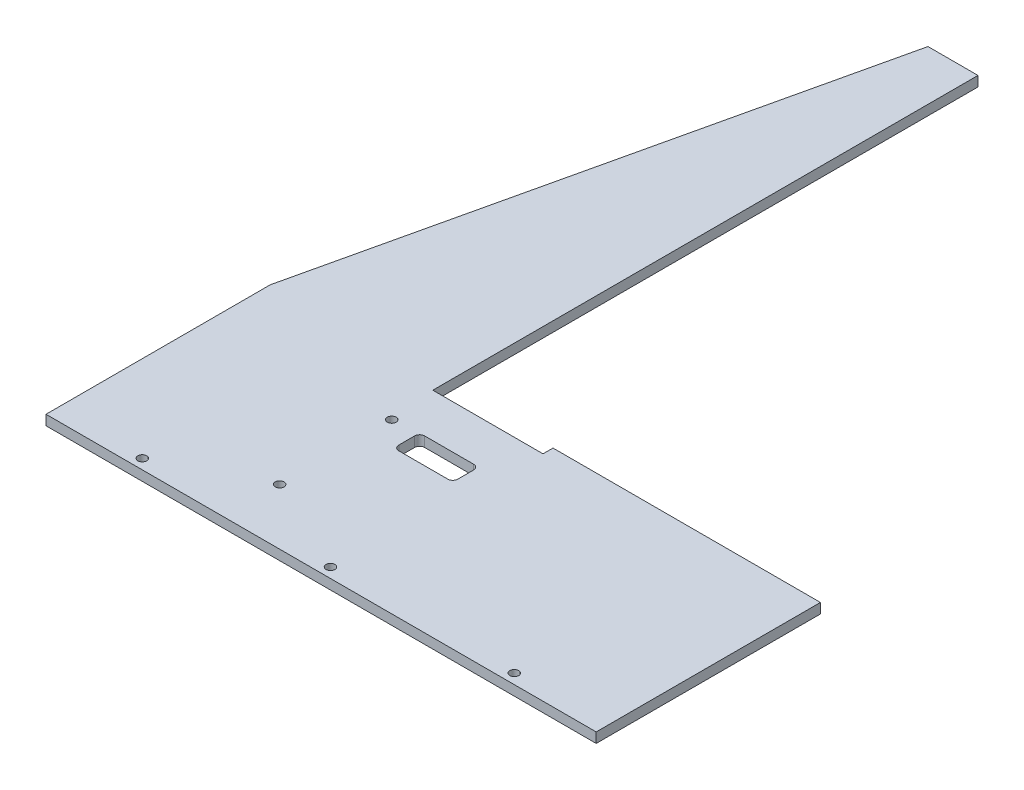
ISO-10303-21;
HEADER;
FILE_DESCRIPTION(('STEP AP214'),'2;1');
FILE_NAME('part.step','',(''),(''),'','','');
FILE_SCHEMA(('AUTOMOTIVE_DESIGN { 1 0 10303 214 1 1 1 1 }'));
ENDSEC;
DATA;
#1=APPLICATION_CONTEXT('core data for automotive mechanical design processes');
#2=APPLICATION_PROTOCOL_DEFINITION('international standard','automotive_design',2000,#1);
#3=PRODUCT_CONTEXT('',#1,'mechanical');
#4=PRODUCT('Part','Part','',(#3));
#5=PRODUCT_RELATED_PRODUCT_CATEGORY('part','',(#4));
#6=PRODUCT_DEFINITION_FORMATION('','',#4);
#7=PRODUCT_DEFINITION_CONTEXT('part definition',#1,'design');
#8=PRODUCT_DEFINITION('design','',#6,#7);
#9=PRODUCT_DEFINITION_SHAPE('','',#8);
#10=(LENGTH_UNIT() NAMED_UNIT(*) SI_UNIT(.MILLI.,.METRE.));
#11=(NAMED_UNIT(*) PLANE_ANGLE_UNIT() SI_UNIT($,.RADIAN.));
#12=(NAMED_UNIT(*) SI_UNIT($,.STERADIAN.) SOLID_ANGLE_UNIT());
#13=UNCERTAINTY_MEASURE_WITH_UNIT(LENGTH_MEASURE(1.E-05),#10,'distance_accuracy_value','');
#14=(GEOMETRIC_REPRESENTATION_CONTEXT(3) GLOBAL_UNCERTAINTY_ASSIGNED_CONTEXT((#13)) GLOBAL_UNIT_ASSIGNED_CONTEXT((#10,
#11,#12)) REPRESENTATION_CONTEXT('',''));
#15=CARTESIAN_POINT('',(0.,0.,0.));
#16=DIRECTION('',(0.,0.,1.));
#17=DIRECTION('',(1.,0.,0.));
#18=AXIS2_PLACEMENT_3D('',#15,#16,#17);
#19=CARTESIAN_POINT('',(224.613859637391,-4.83904434096861,62.9747166997346));
#20=DIRECTION('',(0.,0.,-1.));
#21=DIRECTION('',(-1.,0.,0.));
#22=AXIS2_PLACEMENT_3D('',#19,#20,#21);
#23=PLANE('',#22);
#24=DIRECTION('',(1.,0.,0.));
#25=VECTOR('',#24,1.);
#26=CARTESIAN_POINT('',(224.613859637391,-10.8390443409686,62.9747166997346));
#27=LINE('',#26,#25);
#28=CARTESIAN_POINT('',(-105.386140362609,-10.8390443409686,62.9747166997346));
#29=VERTEX_POINT('',#28);
#30=CARTESIAN_POINT('',(224.613859637391,-10.8390443409686,62.9747166997346));
#31=VERTEX_POINT('',#30);
#32=EDGE_CURVE('E225',#29,#31,#27,.T.);
#33=ORIENTED_EDGE('',*,*,#32,.T.);
#34=DIRECTION('',(0.,-1.,0.));
#35=VECTOR('',#34,1.);
#36=CARTESIAN_POINT('',(224.613859637391,-4.83904434096861,62.9747166997346));
#37=LINE('',#36,#35);
#38=CARTESIAN_POINT('',(224.613859637391,-4.83904434096861,62.9747166997346));
#39=VERTEX_POINT('',#38);
#40=EDGE_CURVE('E266',#39,#31,#37,.T.);
#41=ORIENTED_EDGE('',*,*,#40,.F.);
#42=DIRECTION('',(1.,0.,0.));
#43=VECTOR('',#42,1.);
#44=CARTESIAN_POINT('',(224.613859637391,-4.83904434096861,62.9747166997346));
#45=LINE('',#44,#43);
#46=CARTESIAN_POINT('',(-105.386140362609,-4.83904434096861,62.9747166997346));
#47=VERTEX_POINT('',#46);
#48=EDGE_CURVE('E226',#47,#39,#45,.T.);
#49=ORIENTED_EDGE('',*,*,#48,.F.);
#50=DIRECTION('',(0.,-1.,0.));
#51=VECTOR('',#50,1.);
#52=CARTESIAN_POINT('',(-105.386140362609,-4.83904434096861,62.9747166997346));
#53=LINE('',#52,#51);
#54=EDGE_CURVE('E242',#47,#29,#53,.T.);
#55=ORIENTED_EDGE('',*,*,#54,.T.);
#56=EDGE_LOOP('',(#33,#41,#49,#55));
#57=FACE_BOUND('',#56,.T.);
#58=ADVANCED_FACE('F35',(#57),#23,.F.);
#59=CARTESIAN_POINT('',(224.613859637391,-4.83904434096861,-71.5252833002654));
#60=DIRECTION('',(-1.,0.,0.));
#61=DIRECTION('',(0.,0.,1.));
#62=AXIS2_PLACEMENT_3D('',#59,#60,#61);
#63=PLANE('',#62);
#64=DIRECTION('',(0.,0.,-1.));
#65=VECTOR('',#64,1.);
#66=CARTESIAN_POINT('',(224.613859637391,-10.8390443409686,-71.5252833002654));
#67=LINE('',#66,#65);
#68=CARTESIAN_POINT('',(224.613859637391,-10.8390443409686,-71.5252833002654));
#69=VERTEX_POINT('',#68);
#70=EDGE_CURVE('E245',#31,#69,#67,.T.);
#71=ORIENTED_EDGE('',*,*,#70,.T.);
#72=DIRECTION('',(0.,-1.,0.));
#73=VECTOR('',#72,1.);
#74=CARTESIAN_POINT('',(224.613859637391,-4.83904434096861,-71.5252833002654));
#75=LINE('',#74,#73);
#76=CARTESIAN_POINT('',(224.613859637391,-4.83904434096861,-71.5252833002654));
#77=VERTEX_POINT('',#76);
#78=EDGE_CURVE('E263',#77,#69,#75,.T.);
#79=ORIENTED_EDGE('',*,*,#78,.F.);
#80=DIRECTION('',(0.,0.,-1.));
#81=VECTOR('',#80,1.);
#82=CARTESIAN_POINT('',(224.613859637391,-4.83904434096861,-71.5252833002654));
#83=LINE('',#82,#81);
#84=EDGE_CURVE('E229',#39,#77,#83,.T.);
#85=ORIENTED_EDGE('',*,*,#84,.F.);
#86=ORIENTED_EDGE('',*,*,#40,.T.);
#87=EDGE_LOOP('',(#71,#79,#85,#86));
#88=FACE_BOUND('',#87,.T.);
#89=ADVANCED_FACE('F357',(#88),#63,.F.);
#90=CARTESIAN_POINT('',(-1.88614036260915,-4.83904434096861,-71.5252833002654));
#91=DIRECTION('',(0.,0.,1.));
#92=DIRECTION('',(1.,0.,0.));
#93=AXIS2_PLACEMENT_3D('',#90,#91,#92);
#94=PLANE('',#93);
#95=DIRECTION('',(-1.,0.,0.));
#96=VECTOR('',#95,1.);
#97=CARTESIAN_POINT('',(-1.88614036260915,-10.8390443409686,-71.5252833002654));
#98=LINE('',#97,#96);
#99=CARTESIAN_POINT('',(64.2138596373908,-10.8390443409686,-71.5252833002654));
#100=VERTEX_POINT('',#99);
#101=EDGE_CURVE('E166',#69,#100,#98,.T.);
#102=ORIENTED_EDGE('',*,*,#101,.T.);
#103=DIRECTION('',(0.,1.,0.));
#104=VECTOR('',#103,1.);
#105=CARTESIAN_POINT('',(64.2138596373908,-10.8390443409686,-71.5252833002654));
#106=LINE('',#105,#104);
#107=CARTESIAN_POINT('',(64.2138596373908,-4.83904434096861,-71.5252833002654));
#108=VERTEX_POINT('',#107);
#109=EDGE_CURVE('E191',#100,#108,#106,.T.);
#110=ORIENTED_EDGE('',*,*,#109,.T.);
#111=DIRECTION('',(-1.,0.,0.));
#112=VECTOR('',#111,1.);
#113=CARTESIAN_POINT('',(-1.88614036260915,-4.83904434096861,-71.5252833002654));
#114=LINE('',#113,#112);
#115=EDGE_CURVE('E232',#77,#108,#114,.T.);
#116=ORIENTED_EDGE('',*,*,#115,.F.);
#117=ORIENTED_EDGE('',*,*,#78,.T.);
#118=EDGE_LOOP('',(#102,#110,#116,#117));
#119=FACE_BOUND('',#118,.T.);
#120=ADVANCED_FACE('F363',(#119),#94,.F.);
#121=CARTESIAN_POINT('',(-1.88614036260919,-4.83904434096861,-392.525283300265));
#122=DIRECTION('',(-1.,0.,0.));
#123=DIRECTION('',(0.,0.,1.));
#124=AXIS2_PLACEMENT_3D('',#121,#122,#123);
#125=PLANE('',#124);
#126=DIRECTION('',(0.,0.,-1.));
#127=VECTOR('',#126,1.);
#128=CARTESIAN_POINT('',(-1.88614036260919,-10.8390443409686,-392.525283300265));
#129=LINE('',#128,#127);
#130=CARTESIAN_POINT('',(-1.88614036260915,-10.8390443409686,-65.5252833002654));
#131=VERTEX_POINT('',#130);
#132=CARTESIAN_POINT('',(-1.88614036260919,-10.8390443409686,-392.525283300265));
#133=VERTEX_POINT('',#132);
#134=EDGE_CURVE('E154',#131,#133,#129,.T.);
#135=ORIENTED_EDGE('',*,*,#134,.T.);
#136=DIRECTION('',(0.,-1.,0.));
#137=VECTOR('',#136,1.);
#138=CARTESIAN_POINT('',(-1.88614036260919,-4.83904434096861,-392.525283300265));
#139=LINE('',#138,#137);
#140=CARTESIAN_POINT('',(-1.88614036260919,-4.83904434096861,-392.525283300265));
#141=VERTEX_POINT('',#140);
#142=EDGE_CURVE('E261',#141,#133,#139,.T.);
#143=ORIENTED_EDGE('',*,*,#142,.F.);
#144=DIRECTION('',(0.,0.,-1.));
#145=VECTOR('',#144,1.);
#146=CARTESIAN_POINT('',(-1.88614036260919,-4.83904434096861,-392.525283300265));
#147=LINE('',#146,#145);
#148=CARTESIAN_POINT('',(-1.88614036260915,-4.83904434096861,-65.5252833002654));
#149=VERTEX_POINT('',#148);
#150=EDGE_CURVE('E171',#149,#141,#147,.T.);
#151=ORIENTED_EDGE('',*,*,#150,.F.);
#152=DIRECTION('',(0.,1.,0.));
#153=VECTOR('',#152,1.);
#154=CARTESIAN_POINT('',(-1.88614036260915,-10.8390443409686,-65.5252833002654));
#155=LINE('',#154,#153);
#156=EDGE_CURVE('E169',#131,#149,#155,.T.);
#157=ORIENTED_EDGE('',*,*,#156,.F.);
#158=EDGE_LOOP('',(#135,#143,#151,#157));
#159=FACE_BOUND('',#158,.T.);
#160=ADVANCED_FACE('F170',(#159),#125,.F.);
#161=CARTESIAN_POINT('',(-31.8861403626092,-4.83904434096861,-392.525283300265));
#162=DIRECTION('',(0.,0.,1.));
#163=DIRECTION('',(1.,0.,0.));
#164=AXIS2_PLACEMENT_3D('',#161,#162,#163);
#165=PLANE('',#164);
#166=DIRECTION('',(-1.,0.,0.));
#167=VECTOR('',#166,1.);
#168=CARTESIAN_POINT('',(-31.8861403626092,-10.8390443409686,-392.525283300265));
#169=LINE('',#168,#167);
#170=CARTESIAN_POINT('',(-31.8861403626092,-10.8390443409686,-392.525283300265));
#171=VERTEX_POINT('',#170);
#172=EDGE_CURVE('E162',#133,#171,#169,.T.);
#173=ORIENTED_EDGE('',*,*,#172,.T.);
#174=DIRECTION('',(0.,-1.,0.));
#175=VECTOR('',#174,1.);
#176=CARTESIAN_POINT('',(-31.8861403626092,-4.83904434096861,-392.525283300265));
#177=LINE('',#176,#175);
#178=CARTESIAN_POINT('',(-31.8861403626092,-4.83904434096861,-392.525283300265));
#179=VERTEX_POINT('',#178);
#180=EDGE_CURVE('E258',#179,#171,#177,.T.);
#181=ORIENTED_EDGE('',*,*,#180,.F.);
#182=DIRECTION('',(-1.,0.,0.));
#183=VECTOR('',#182,1.);
#184=CARTESIAN_POINT('',(-31.8861403626092,-4.83904434096861,-392.525283300265));
#185=LINE('',#184,#183);
#186=EDGE_CURVE('E236',#141,#179,#185,.T.);
#187=ORIENTED_EDGE('',*,*,#186,.F.);
#188=ORIENTED_EDGE('',*,*,#142,.T.);
#189=EDGE_LOOP('',(#173,#181,#187,#188));
#190=FACE_BOUND('',#189,.T.);
#191=ADVANCED_FACE('F418',(#190),#165,.F.);
#192=CARTESIAN_POINT('',(-105.386140362609,-4.83904434096861,-71.5252833002654));
#193=DIRECTION('',(0.974773625713798,0.,0.223195830186804));
#194=DIRECTION('',(0.223195830186804,0.,-0.974773625713798));
#195=AXIS2_PLACEMENT_3D('',#192,#193,#194);
#196=PLANE('',#195);
#197=DIRECTION('',(-0.223195830186804,0.,0.974773625713798));
#198=VECTOR('',#197,1.);
#199=CARTESIAN_POINT('',(-105.386140362609,-10.8390443409686,-71.5252833002654));
#200=LINE('',#199,#198);
#201=CARTESIAN_POINT('',(-105.386140362609,-10.8390443409686,-71.5252833002654));
#202=VERTEX_POINT('',#201);
#203=EDGE_CURVE('E250',#171,#202,#200,.T.);
#204=ORIENTED_EDGE('',*,*,#203,.T.);
#205=DIRECTION('',(0.,-1.,0.));
#206=VECTOR('',#205,1.);
#207=CARTESIAN_POINT('',(-105.386140362609,-4.83904434096861,-71.5252833002654));
#208=LINE('',#207,#206);
#209=CARTESIAN_POINT('',(-105.386140362609,-4.83904434096861,-71.5252833002654));
#210=VERTEX_POINT('',#209);
#211=EDGE_CURVE('E255',#210,#202,#208,.T.);
#212=ORIENTED_EDGE('',*,*,#211,.F.);
#213=DIRECTION('',(-0.223195830186804,0.,0.974773625713798));
#214=VECTOR('',#213,1.);
#215=CARTESIAN_POINT('',(-105.386140362609,-4.83904434096861,-71.5252833002654));
#216=LINE('',#215,#214);
#217=EDGE_CURVE('E238',#179,#210,#216,.T.);
#218=ORIENTED_EDGE('',*,*,#217,.F.);
#219=ORIENTED_EDGE('',*,*,#180,.T.);
#220=EDGE_LOOP('',(#204,#212,#218,#219));
#221=FACE_BOUND('',#220,.T.);
#222=ADVANCED_FACE('F414',(#221),#196,.F.);
#223=CARTESIAN_POINT('',(-105.386140362609,-4.83904434096861,62.9747166997346));
#224=DIRECTION('',(1.,0.,0.));
#225=DIRECTION('',(0.,0.,-1.));
#226=AXIS2_PLACEMENT_3D('',#223,#224,#225);
#227=PLANE('',#226);
#228=DIRECTION('',(0.,0.,1.));
#229=VECTOR('',#228,1.);
#230=CARTESIAN_POINT('',(-105.386140362609,-10.8390443409686,62.9747166997346));
#231=LINE('',#230,#229);
#232=EDGE_CURVE('E230',#202,#29,#231,.T.);
#233=ORIENTED_EDGE('',*,*,#232,.T.);
#234=ORIENTED_EDGE('',*,*,#54,.F.);
#235=DIRECTION('',(0.,0.,1.));
#236=VECTOR('',#235,1.);
#237=CARTESIAN_POINT('',(-105.386140362609,-4.83904434096861,62.9747166997346));
#238=LINE('',#237,#236);
#239=EDGE_CURVE('E240',#210,#47,#238,.T.);
#240=ORIENTED_EDGE('',*,*,#239,.F.);
#241=ORIENTED_EDGE('',*,*,#211,.T.);
#242=EDGE_LOOP('',(#233,#234,#240,#241));
#243=FACE_BOUND('',#242,.T.);
#244=ADVANCED_FACE('F409',(#243),#227,.F.);
#245=CARTESIAN_POINT('',(-105.386140362609,-4.83904434096861,62.9747166997346));
#246=DIRECTION('',(0.,-1.,0.));
#247=DIRECTION('',(0.,0.,-1.));
#248=AXIS2_PLACEMENT_3D('',#245,#246,#247);
#249=PLANE('',#248);
#250=DIRECTION('',(1.,0.,0.));
#251=VECTOR('',#250,1.);
#252=CARTESIAN_POINT('',(16.4138596373909,-4.83904434096861,-23.8252833002657));
#253=LINE('',#252,#251);
#254=CARTESIAN_POINT('',(19.4138596373909,-4.83904434096861,-23.8252833002657));
#255=VERTEX_POINT('',#254);
#256=CARTESIAN_POINT('',(48.8138596373909,-4.83904434096861,-23.8252833002657));
#257=VERTEX_POINT('',#256);
#258=EDGE_CURVE('E328',#255,#257,#253,.T.);
#259=ORIENTED_EDGE('',*,*,#258,.F.);
#260=CARTESIAN_POINT('',(19.4138596373909,-4.83904434096861,-26.8252833002657));
#261=DIRECTION('',(0.,-1.,0.));
#262=DIRECTION('',(0.,0.,-1.));
#263=AXIS2_PLACEMENT_3D('',#260,#261,#262);
#264=CIRCLE('',#263,3.);
#265=CARTESIAN_POINT('',(16.4138596373909,-4.83904434096861,-26.8252833002657));
#266=VERTEX_POINT('',#265);
#267=EDGE_CURVE('E296',#255,#266,#264,.T.);
#268=ORIENTED_EDGE('',*,*,#267,.T.);
#269=DIRECTION('',(0.,0.,1.));
#270=VECTOR('',#269,1.);
#271=CARTESIAN_POINT('',(16.4138596373909,-4.83904434096861,-39.3252833002654));
#272=LINE('',#271,#270);
#273=CARTESIAN_POINT('',(16.4138596373909,-4.83904434096861,-36.3252833002654));
#274=VERTEX_POINT('',#273);
#275=EDGE_CURVE('E306',#274,#266,#272,.T.);
#276=ORIENTED_EDGE('',*,*,#275,.F.);
#277=CARTESIAN_POINT('',(19.4138596373909,-4.83904434096861,-36.3252833002654));
#278=DIRECTION('',(0.,-1.,0.));
#279=DIRECTION('',(0.,0.,-1.));
#280=AXIS2_PLACEMENT_3D('',#277,#278,#279);
#281=CIRCLE('',#280,3.);
#282=CARTESIAN_POINT('',(19.4138596373909,-4.83904434096861,-39.3252833002654));
#283=VERTEX_POINT('',#282);
#284=EDGE_CURVE('E43',#274,#283,#281,.T.);
#285=ORIENTED_EDGE('',*,*,#284,.T.);
#286=DIRECTION('',(-1.,0.,0.));
#287=VECTOR('',#286,1.);
#288=CARTESIAN_POINT('',(16.4138596373909,-4.83904434096861,-39.3252833002654));
#289=LINE('',#288,#287);
#290=CARTESIAN_POINT('',(48.8138596373909,-4.83904434096861,-39.3252833002654));
#291=VERTEX_POINT('',#290);
#292=EDGE_CURVE('E186',#291,#283,#289,.T.);
#293=ORIENTED_EDGE('',*,*,#292,.F.);
#294=CARTESIAN_POINT('',(48.8138596373909,-4.83904434096861,-36.3252833002654));
#295=DIRECTION('',(0.,-1.,0.));
#296=DIRECTION('',(0.,0.,-1.));
#297=AXIS2_PLACEMENT_3D('',#294,#295,#296);
#298=CIRCLE('',#297,3.);
#299=CARTESIAN_POINT('',(51.8138596373909,-4.83904434096861,-36.3252833002654));
#300=VERTEX_POINT('',#299);
#301=EDGE_CURVE('E288',#291,#300,#298,.T.);
#302=ORIENTED_EDGE('',*,*,#301,.T.);
#303=DIRECTION('',(0.,0.,-1.));
#304=VECTOR('',#303,1.);
#305=CARTESIAN_POINT('',(51.8138596373909,-4.83904434096861,-39.3252833002654));
#306=LINE('',#305,#304);
#307=CARTESIAN_POINT('',(51.8138596373909,-4.83904434096861,-26.8252833002657));
#308=VERTEX_POINT('',#307);
#309=EDGE_CURVE('E315',#308,#300,#306,.T.);
#310=ORIENTED_EDGE('',*,*,#309,.F.);
#311=CARTESIAN_POINT('',(48.8138596373909,-4.83904434096861,-26.8252833002657));
#312=DIRECTION('',(0.,-1.,0.));
#313=DIRECTION('',(0.,0.,-1.));
#314=AXIS2_PLACEMENT_3D('',#311,#312,#313);
#315=CIRCLE('',#314,3.);
#316=EDGE_CURVE('E292',#308,#257,#315,.T.);
#317=ORIENTED_EDGE('',*,*,#316,.T.);
#318=EDGE_LOOP('',(#259,#268,#276,#285,#293,#302,#310,#317));
#319=FACE_BOUND('',#318,.T.);
#320=CARTESIAN_POINT('',(-53.6361403626092,-4.83904434096861,56.9747166997346));
#321=DIRECTION('',(0.,1.,0.));
#322=DIRECTION('',(0.,0.,1.));
#323=AXIS2_PLACEMENT_3D('',#320,#321,#322);
#324=CIRCLE('',#323,2.64999999999999);
#325=CARTESIAN_POINT('',(-53.6361403626092,-4.83904434096861,59.6247166997346));
#326=VERTEX_POINT('',#325);
#327=EDGE_CURVE('E194',#326,#326,#324,.T.);
#328=ORIENTED_EDGE('',*,*,#327,.F.);
#329=EDGE_LOOP('',(#328));
#330=FACE_BOUND('',#329,.T.);
#331=CARTESIAN_POINT('',(59.2388596373907,-4.83904434096861,56.9747166997346));
#332=DIRECTION('',(0.,1.,0.));
#333=DIRECTION('',(0.,0.,1.));
#334=AXIS2_PLACEMENT_3D('',#331,#332,#333);
#335=CIRCLE('',#334,2.64999999999999);
#336=CARTESIAN_POINT('',(59.2388596373907,-4.83904434096861,59.6247166997346));
#337=VERTEX_POINT('',#336);
#338=EDGE_CURVE('E201',#337,#337,#335,.T.);
#339=ORIENTED_EDGE('',*,*,#338,.F.);
#340=EDGE_LOOP('',(#339));
#341=FACE_BOUND('',#340,.T.);
#342=CARTESIAN_POINT('',(169.488859637391,-4.83904434096861,56.9747166997346));
#343=DIRECTION('',(0.,1.,0.));
#344=DIRECTION('',(0.,0.,1.));
#345=AXIS2_PLACEMENT_3D('',#342,#343,#344);
#346=CIRCLE('',#345,2.64999999999999);
#347=CARTESIAN_POINT('',(169.488859637391,-4.83904434096861,59.6247166997346));
#348=VERTEX_POINT('',#347);
#349=EDGE_CURVE('E207',#348,#348,#346,.T.);
#350=ORIENTED_EDGE('',*,*,#349,.F.);
#351=EDGE_LOOP('',(#350));
#352=FACE_BOUND('',#351,.T.);
#353=CARTESIAN_POINT('',(1.11385963739087,-4.83904434096861,29.3497166997346));
#354=DIRECTION('',(0.,1.,0.));
#355=DIRECTION('',(0.,0.,1.));
#356=AXIS2_PLACEMENT_3D('',#353,#354,#355);
#357=CIRCLE('',#356,2.64999999999999);
#358=CARTESIAN_POINT('',(1.11385963739087,-4.83904434096861,31.9997166997346));
#359=VERTEX_POINT('',#358);
#360=EDGE_CURVE('E213',#359,#359,#357,.T.);
#361=ORIENTED_EDGE('',*,*,#360,.F.);
#362=EDGE_LOOP('',(#361));
#363=FACE_BOUND('',#362,.T.);
#364=CARTESIAN_POINT('',(1.11385963739086,-4.83904434096861,-37.9002833002654));
#365=DIRECTION('',(0.,1.,0.));
#366=DIRECTION('',(0.,0.,1.));
#367=AXIS2_PLACEMENT_3D('',#364,#365,#366);
#368=CIRCLE('',#367,2.64999999999999);
#369=CARTESIAN_POINT('',(1.11385963739086,-4.83904434096861,-35.2502833002654));
#370=VERTEX_POINT('',#369);
#371=EDGE_CURVE('E219',#370,#370,#368,.T.);
#372=ORIENTED_EDGE('',*,*,#371,.F.);
#373=EDGE_LOOP('',(#372));
#374=FACE_BOUND('',#373,.T.);
#375=DIRECTION('',(1.,0.,0.));
#376=VECTOR('',#375,1.);
#377=CARTESIAN_POINT('',(-1.88614036260915,-4.83904434096861,-65.5252833002654));
#378=LINE('',#377,#376);
#379=CARTESIAN_POINT('',(64.2138596373908,-4.83904434096861,-65.5252833002654));
#380=VERTEX_POINT('',#379);
#381=EDGE_CURVE('E183',#149,#380,#378,.T.);
#382=ORIENTED_EDGE('',*,*,#381,.F.);
#383=ORIENTED_EDGE('',*,*,#150,.T.);
#384=ORIENTED_EDGE('',*,*,#186,.T.);
#385=ORIENTED_EDGE('',*,*,#217,.T.);
#386=ORIENTED_EDGE('',*,*,#239,.T.);
#387=ORIENTED_EDGE('',*,*,#48,.T.);
#388=ORIENTED_EDGE('',*,*,#84,.T.);
#389=ORIENTED_EDGE('',*,*,#115,.T.);
#390=DIRECTION('',(0.,0.,-1.));
#391=VECTOR('',#390,1.);
#392=CARTESIAN_POINT('',(64.2138596373908,-4.83904434096861,-71.5252833002654));
#393=LINE('',#392,#391);
#394=EDGE_CURVE('E180',#380,#108,#393,.T.);
#395=ORIENTED_EDGE('',*,*,#394,.F.);
#396=EDGE_LOOP('',(#382,#383,#384,#385,#386,#387,#388,#389,#395));
#397=FACE_BOUND('',#396,.T.);
#398=ADVANCED_FACE('F304',(#319,#330,#341,#352,#363,#374,#397),#249,.F.);
#399=CARTESIAN_POINT('',(-105.386140362609,-10.8390443409686,62.9747166997346));
#400=DIRECTION('',(0.,-1.,0.));
#401=DIRECTION('',(0.,0.,-1.));
#402=AXIS2_PLACEMENT_3D('',#399,#400,#401);
#403=PLANE('',#402);
#404=DIRECTION('',(-1.,0.,0.));
#405=VECTOR('',#404,1.);
#406=CARTESIAN_POINT('',(16.4138596373909,-10.8390443409686,-39.3252833002654));
#407=LINE('',#406,#405);
#408=CARTESIAN_POINT('',(48.8138596373909,-10.8390443409686,-39.3252833002654));
#409=VERTEX_POINT('',#408);
#410=CARTESIAN_POINT('',(19.4138596373909,-10.8390443409686,-39.3252833002654));
#411=VERTEX_POINT('',#410);
#412=EDGE_CURVE('E189',#409,#411,#407,.T.);
#413=ORIENTED_EDGE('',*,*,#412,.T.);
#414=CARTESIAN_POINT('',(19.4138596373909,-10.8390443409686,-36.3252833002654));
#415=DIRECTION('',(0.,-1.,0.));
#416=DIRECTION('',(0.,0.,-1.));
#417=AXIS2_PLACEMENT_3D('',#414,#415,#416);
#418=CIRCLE('',#417,3.);
#419=CARTESIAN_POINT('',(16.4138596373909,-10.8390443409686,-36.3252833002654));
#420=VERTEX_POINT('',#419);
#421=EDGE_CURVE('E11',#411,#420,#418,.F.);
#422=ORIENTED_EDGE('',*,*,#421,.T.);
#423=DIRECTION('',(0.,0.,1.));
#424=VECTOR('',#423,1.);
#425=CARTESIAN_POINT('',(16.4138596373909,-10.8390443409686,-39.3252833002654));
#426=LINE('',#425,#424);
#427=CARTESIAN_POINT('',(16.4138596373909,-10.8390443409686,-26.8252833002657));
#428=VERTEX_POINT('',#427);
#429=EDGE_CURVE('E314',#420,#428,#426,.T.);
#430=ORIENTED_EDGE('',*,*,#429,.T.);
#431=CARTESIAN_POINT('',(19.4138596373909,-10.8390443409686,-26.8252833002657));
#432=DIRECTION('',(0.,-1.,0.));
#433=DIRECTION('',(0.,0.,-1.));
#434=AXIS2_PLACEMENT_3D('',#431,#432,#433);
#435=CIRCLE('',#434,3.);
#436=CARTESIAN_POINT('',(19.4138596373909,-10.8390443409686,-23.8252833002657));
#437=VERTEX_POINT('',#436);
#438=EDGE_CURVE('E298',#428,#437,#435,.F.);
#439=ORIENTED_EDGE('',*,*,#438,.T.);
#440=DIRECTION('',(1.,0.,0.));
#441=VECTOR('',#440,1.);
#442=CARTESIAN_POINT('',(16.4138596373909,-10.8390443409686,-23.8252833002657));
#443=LINE('',#442,#441);
#444=CARTESIAN_POINT('',(48.8138596373909,-10.8390443409686,-23.8252833002657));
#445=VERTEX_POINT('',#444);
#446=EDGE_CURVE('E318',#437,#445,#443,.T.);
#447=ORIENTED_EDGE('',*,*,#446,.T.);
#448=CARTESIAN_POINT('',(48.8138596373909,-10.8390443409686,-26.8252833002657));
#449=DIRECTION('',(0.,-1.,0.));
#450=DIRECTION('',(0.,0.,-1.));
#451=AXIS2_PLACEMENT_3D('',#448,#449,#450);
#452=CIRCLE('',#451,3.);
#453=CARTESIAN_POINT('',(51.8138596373909,-10.8390443409686,-26.8252833002657));
#454=VERTEX_POINT('',#453);
#455=EDGE_CURVE('E294',#445,#454,#452,.F.);
#456=ORIENTED_EDGE('',*,*,#455,.T.);
#457=DIRECTION('',(0.,0.,-1.));
#458=VECTOR('',#457,1.);
#459=CARTESIAN_POINT('',(51.8138596373909,-10.8390443409686,-39.3252833002654));
#460=LINE('',#459,#458);
#461=CARTESIAN_POINT('',(51.8138596373909,-10.8390443409686,-36.3252833002654));
#462=VERTEX_POINT('',#461);
#463=EDGE_CURVE('E321',#454,#462,#460,.T.);
#464=ORIENTED_EDGE('',*,*,#463,.T.);
#465=CARTESIAN_POINT('',(48.8138596373909,-10.8390443409686,-36.3252833002654));
#466=DIRECTION('',(0.,-1.,0.));
#467=DIRECTION('',(0.,0.,-1.));
#468=AXIS2_PLACEMENT_3D('',#465,#466,#467);
#469=CIRCLE('',#468,3.);
#470=EDGE_CURVE('E290',#462,#409,#469,.F.);
#471=ORIENTED_EDGE('',*,*,#470,.T.);
#472=EDGE_LOOP('',(#413,#422,#430,#439,#447,#456,#464,#471));
#473=FACE_BOUND('',#472,.T.);
#474=ORIENTED_EDGE('',*,*,#134,.F.);
#475=DIRECTION('',(1.,0.,0.));
#476=VECTOR('',#475,1.);
#477=CARTESIAN_POINT('',(-1.88614036260915,-10.8390443409686,-65.5252833002654));
#478=LINE('',#477,#476);
#479=CARTESIAN_POINT('',(64.2138596373908,-10.8390443409686,-65.5252833002654));
#480=VERTEX_POINT('',#479);
#481=EDGE_CURVE('E160',#131,#480,#478,.T.);
#482=ORIENTED_EDGE('',*,*,#481,.T.);
#483=DIRECTION('',(0.,0.,-1.));
#484=VECTOR('',#483,1.);
#485=CARTESIAN_POINT('',(64.2138596373908,-10.8390443409686,-71.5252833002654));
#486=LINE('',#485,#484);
#487=EDGE_CURVE('E176',#480,#100,#486,.T.);
#488=ORIENTED_EDGE('',*,*,#487,.T.);
#489=ORIENTED_EDGE('',*,*,#101,.F.);
#490=ORIENTED_EDGE('',*,*,#70,.F.);
#491=ORIENTED_EDGE('',*,*,#32,.F.);
#492=ORIENTED_EDGE('',*,*,#232,.F.);
#493=ORIENTED_EDGE('',*,*,#203,.F.);
#494=ORIENTED_EDGE('',*,*,#172,.F.);
#495=EDGE_LOOP('',(#474,#482,#488,#489,#490,#491,#492,#493,#494));
#496=FACE_BOUND('',#495,.T.);
#497=CARTESIAN_POINT('',(-53.6361403626092,-10.8390443409686,56.9747166997346));
#498=DIRECTION('',(0.,1.,0.));
#499=DIRECTION('',(0.,0.,1.));
#500=AXIS2_PLACEMENT_3D('',#497,#498,#499);
#501=CIRCLE('',#500,2.64999999999999);
#502=CARTESIAN_POINT('',(-53.6361403626092,-10.8390443409686,59.6247166997346));
#503=VERTEX_POINT('',#502);
#504=EDGE_CURVE('E198',#503,#503,#501,.T.);
#505=ORIENTED_EDGE('',*,*,#504,.T.);
#506=EDGE_LOOP('',(#505));
#507=FACE_BOUND('',#506,.T.);
#508=CARTESIAN_POINT('',(59.2388596373907,-10.8390443409686,56.9747166997346));
#509=DIRECTION('',(0.,1.,0.));
#510=DIRECTION('',(0.,0.,1.));
#511=AXIS2_PLACEMENT_3D('',#508,#509,#510);
#512=CIRCLE('',#511,2.64999999999999);
#513=CARTESIAN_POINT('',(59.2388596373907,-10.8390443409686,59.6247166997346));
#514=VERTEX_POINT('',#513);
#515=EDGE_CURVE('E204',#514,#514,#512,.T.);
#516=ORIENTED_EDGE('',*,*,#515,.T.);
#517=EDGE_LOOP('',(#516));
#518=FACE_BOUND('',#517,.T.);
#519=CARTESIAN_POINT('',(169.488859637391,-10.8390443409686,56.9747166997346));
#520=DIRECTION('',(0.,1.,0.));
#521=DIRECTION('',(0.,0.,1.));
#522=AXIS2_PLACEMENT_3D('',#519,#520,#521);
#523=CIRCLE('',#522,2.64999999999999);
#524=CARTESIAN_POINT('',(169.488859637391,-10.8390443409686,59.6247166997346));
#525=VERTEX_POINT('',#524);
#526=EDGE_CURVE('E210',#525,#525,#523,.T.);
#527=ORIENTED_EDGE('',*,*,#526,.T.);
#528=EDGE_LOOP('',(#527));
#529=FACE_BOUND('',#528,.T.);
#530=CARTESIAN_POINT('',(1.11385963739087,-10.8390443409686,29.3497166997346));
#531=DIRECTION('',(0.,1.,0.));
#532=DIRECTION('',(0.,0.,1.));
#533=AXIS2_PLACEMENT_3D('',#530,#531,#532);
#534=CIRCLE('',#533,2.64999999999999);
#535=CARTESIAN_POINT('',(1.11385963739087,-10.8390443409686,31.9997166997346));
#536=VERTEX_POINT('',#535);
#537=EDGE_CURVE('E216',#536,#536,#534,.T.);
#538=ORIENTED_EDGE('',*,*,#537,.T.);
#539=EDGE_LOOP('',(#538));
#540=FACE_BOUND('',#539,.T.);
#541=CARTESIAN_POINT('',(1.11385963739086,-10.8390443409686,-37.9002833002654));
#542=DIRECTION('',(0.,1.,0.));
#543=DIRECTION('',(0.,0.,1.));
#544=AXIS2_PLACEMENT_3D('',#541,#542,#543);
#545=CIRCLE('',#544,2.64999999999999);
#546=CARTESIAN_POINT('',(1.11385963739086,-10.8390443409686,-35.2502833002654));
#547=VERTEX_POINT('',#546);
#548=EDGE_CURVE('E222',#547,#547,#545,.T.);
#549=ORIENTED_EDGE('',*,*,#548,.T.);
#550=EDGE_LOOP('',(#549));
#551=FACE_BOUND('',#550,.T.);
#552=ADVANCED_FACE('F156',(#473,#496,#507,#518,#529,#540,#551),#403,.T.);
#553=CARTESIAN_POINT('',(1.11385963739086,-4.83904434096861,-37.9002833002654));
#554=DIRECTION('',(0.,1.,0.));
#555=DIRECTION('',(0.,0.,1.));
#556=AXIS2_PLACEMENT_3D('',#553,#554,#555);
#557=CYLINDRICAL_SURFACE('',#556,2.64999999999999);
#558=ORIENTED_EDGE('',*,*,#548,.F.);
#559=EDGE_LOOP('',(#558));
#560=FACE_BOUND('',#559,.T.);
#561=ORIENTED_EDGE('',*,*,#371,.T.);
#562=EDGE_LOOP('',(#561));
#563=FACE_BOUND('',#562,.T.);
#564=ADVANCED_FACE('F402',(#560,#563),#557,.F.);
#565=CARTESIAN_POINT('',(1.11385963739087,-4.83904434096861,29.3497166997346));
#566=DIRECTION('',(0.,1.,0.));
#567=DIRECTION('',(0.,0.,1.));
#568=AXIS2_PLACEMENT_3D('',#565,#566,#567);
#569=CYLINDRICAL_SURFACE('',#568,2.64999999999999);
#570=ORIENTED_EDGE('',*,*,#537,.F.);
#571=EDGE_LOOP('',(#570));
#572=FACE_BOUND('',#571,.T.);
#573=ORIENTED_EDGE('',*,*,#360,.T.);
#574=EDGE_LOOP('',(#573));
#575=FACE_BOUND('',#574,.T.);
#576=ADVANCED_FACE('F398',(#572,#575),#569,.F.);
#577=CARTESIAN_POINT('',(169.488859637391,-4.83904434096861,56.9747166997346));
#578=DIRECTION('',(0.,1.,0.));
#579=DIRECTION('',(0.,0.,1.));
#580=AXIS2_PLACEMENT_3D('',#577,#578,#579);
#581=CYLINDRICAL_SURFACE('',#580,2.64999999999999);
#582=ORIENTED_EDGE('',*,*,#526,.F.);
#583=EDGE_LOOP('',(#582));
#584=FACE_BOUND('',#583,.T.);
#585=ORIENTED_EDGE('',*,*,#349,.T.);
#586=EDGE_LOOP('',(#585));
#587=FACE_BOUND('',#586,.T.);
#588=ADVANCED_FACE('F394',(#584,#587),#581,.F.);
#589=CARTESIAN_POINT('',(59.2388596373907,-4.83904434096861,56.9747166997346));
#590=DIRECTION('',(0.,1.,0.));
#591=DIRECTION('',(0.,0.,1.));
#592=AXIS2_PLACEMENT_3D('',#589,#590,#591);
#593=CYLINDRICAL_SURFACE('',#592,2.64999999999999);
#594=ORIENTED_EDGE('',*,*,#515,.F.);
#595=EDGE_LOOP('',(#594));
#596=FACE_BOUND('',#595,.T.);
#597=ORIENTED_EDGE('',*,*,#338,.T.);
#598=EDGE_LOOP('',(#597));
#599=FACE_BOUND('',#598,.T.);
#600=ADVANCED_FACE('F390',(#596,#599),#593,.F.);
#601=CARTESIAN_POINT('',(-53.6361403626092,-4.83904434096861,56.9747166997346));
#602=DIRECTION('',(0.,1.,0.));
#603=DIRECTION('',(0.,0.,1.));
#604=AXIS2_PLACEMENT_3D('',#601,#602,#603);
#605=CYLINDRICAL_SURFACE('',#604,2.64999999999999);
#606=ORIENTED_EDGE('',*,*,#504,.F.);
#607=EDGE_LOOP('',(#606));
#608=FACE_BOUND('',#607,.T.);
#609=ORIENTED_EDGE('',*,*,#327,.T.);
#610=EDGE_LOOP('',(#609));
#611=FACE_BOUND('',#610,.T.);
#612=ADVANCED_FACE('F384',(#608,#611),#605,.F.);
#613=CARTESIAN_POINT('',(64.2138596373908,-10.8390443409686,-71.5252833002654));
#614=DIRECTION('',(1.,0.,0.));
#615=DIRECTION('',(0.,0.,-1.));
#616=AXIS2_PLACEMENT_3D('',#613,#614,#615);
#617=PLANE('',#616);
#618=ORIENTED_EDGE('',*,*,#394,.T.);
#619=ORIENTED_EDGE('',*,*,#109,.F.);
#620=ORIENTED_EDGE('',*,*,#487,.F.);
#621=DIRECTION('',(0.,1.,0.));
#622=VECTOR('',#621,1.);
#623=CARTESIAN_POINT('',(64.2138596373908,-10.8390443409686,-65.5252833002654));
#624=LINE('',#623,#622);
#625=EDGE_CURVE('E175',#480,#380,#624,.T.);
#626=ORIENTED_EDGE('',*,*,#625,.T.);
#627=EDGE_LOOP('',(#618,#619,#620,#626));
#628=FACE_BOUND('',#627,.T.);
#629=ADVANCED_FACE('F381',(#628),#617,.F.);
#630=CARTESIAN_POINT('',(-1.88614036260915,-10.8390443409686,-65.5252833002654));
#631=DIRECTION('',(0.,0.,1.));
#632=DIRECTION('',(1.,0.,0.));
#633=AXIS2_PLACEMENT_3D('',#630,#631,#632);
#634=PLANE('',#633);
#635=ORIENTED_EDGE('',*,*,#381,.T.);
#636=ORIENTED_EDGE('',*,*,#625,.F.);
#637=ORIENTED_EDGE('',*,*,#481,.F.);
#638=ORIENTED_EDGE('',*,*,#156,.T.);
#639=EDGE_LOOP('',(#635,#636,#637,#638));
#640=FACE_BOUND('',#639,.T.);
#641=ADVANCED_FACE('F179',(#640),#634,.F.);
#642=CARTESIAN_POINT('',(16.4138596373909,-10.8390443409686,-39.3252833002654));
#643=DIRECTION('',(-1.,0.,0.));
#644=DIRECTION('',(0.,0.,1.));
#645=AXIS2_PLACEMENT_3D('',#642,#643,#644);
#646=PLANE('',#645);
#647=ORIENTED_EDGE('',*,*,#275,.T.);
#648=DIRECTION('',(0.,1.,0.));
#649=VECTOR('',#648,1.);
#650=CARTESIAN_POINT('',(16.4138596373909,-10.8390443409686,-26.8252833002657));
#651=LINE('',#650,#649);
#652=EDGE_CURVE('E50',#266,#428,#651,.F.);
#653=ORIENTED_EDGE('',*,*,#652,.T.);
#654=ORIENTED_EDGE('',*,*,#429,.F.);
#655=DIRECTION('',(0.,1.,0.));
#656=VECTOR('',#655,1.);
#657=CARTESIAN_POINT('',(16.4138596373909,-4.83904434096861,-36.3252833002654));
#658=LINE('',#657,#656);
#659=EDGE_CURVE('E284',#420,#274,#658,.T.);
#660=ORIENTED_EDGE('',*,*,#659,.T.);
#661=EDGE_LOOP('',(#647,#653,#654,#660));
#662=FACE_BOUND('',#661,.T.);
#663=ADVANCED_FACE('F316',(#662),#646,.F.);
#664=CARTESIAN_POINT('',(16.4138596373909,-10.8390443409686,-39.3252833002654));
#665=DIRECTION('',(0.,0.,-1.));
#666=DIRECTION('',(-1.,0.,0.));
#667=AXIS2_PLACEMENT_3D('',#664,#665,#666);
#668=PLANE('',#667);
#669=ORIENTED_EDGE('',*,*,#412,.F.);
#670=DIRECTION('',(0.,1.,0.));
#671=VECTOR('',#670,1.);
#672=CARTESIAN_POINT('',(48.8138596373909,-4.83904434096861,-39.3252833002654));
#673=LINE('',#672,#671);
#674=EDGE_CURVE('E271',#409,#291,#673,.T.);
#675=ORIENTED_EDGE('',*,*,#674,.T.);
#676=ORIENTED_EDGE('',*,*,#292,.T.);
#677=DIRECTION('',(0.,1.,0.));
#678=VECTOR('',#677,1.);
#679=CARTESIAN_POINT('',(19.4138596373909,-10.8390443409686,-39.3252833002654));
#680=LINE('',#679,#678);
#681=EDGE_CURVE('E269',#283,#411,#680,.F.);
#682=ORIENTED_EDGE('',*,*,#681,.T.);
#683=EDGE_LOOP('',(#669,#675,#676,#682));
#684=FACE_BOUND('',#683,.T.);
#685=ADVANCED_FACE('F312',(#684),#668,.F.);
#686=CARTESIAN_POINT('',(51.8138596373909,-10.8390443409686,-39.3252833002654));
#687=DIRECTION('',(1.,0.,0.));
#688=DIRECTION('',(0.,0.,-1.));
#689=AXIS2_PLACEMENT_3D('',#686,#687,#688);
#690=PLANE('',#689);
#691=ORIENTED_EDGE('',*,*,#309,.T.);
#692=DIRECTION('',(0.,1.,0.));
#693=VECTOR('',#692,1.);
#694=CARTESIAN_POINT('',(51.8138596373909,-10.8390443409686,-36.3252833002654));
#695=LINE('',#694,#693);
#696=EDGE_CURVE('E277',#300,#462,#695,.F.);
#697=ORIENTED_EDGE('',*,*,#696,.T.);
#698=ORIENTED_EDGE('',*,*,#463,.F.);
#699=DIRECTION('',(0.,1.,0.));
#700=VECTOR('',#699,1.);
#701=CARTESIAN_POINT('',(51.8138596373909,-4.83904434096861,-26.8252833002657));
#702=LINE('',#701,#700);
#703=EDGE_CURVE('E274',#454,#308,#702,.T.);
#704=ORIENTED_EDGE('',*,*,#703,.T.);
#705=EDGE_LOOP('',(#691,#697,#698,#704));
#706=FACE_BOUND('',#705,.T.);
#707=ADVANCED_FACE('F334',(#706),#690,.F.);
#708=CARTESIAN_POINT('',(16.4138596373909,-10.8390443409686,-23.8252833002657));
#709=DIRECTION('',(0.,0.,1.));
#710=DIRECTION('',(1.,0.,0.));
#711=AXIS2_PLACEMENT_3D('',#708,#709,#710);
#712=PLANE('',#711);
#713=ORIENTED_EDGE('',*,*,#258,.T.);
#714=DIRECTION('',(0.,1.,0.));
#715=VECTOR('',#714,1.);
#716=CARTESIAN_POINT('',(48.8138596373909,-10.8390443409686,-23.8252833002657));
#717=LINE('',#716,#715);
#718=EDGE_CURVE('E282',#257,#445,#717,.F.);
#719=ORIENTED_EDGE('',*,*,#718,.T.);
#720=ORIENTED_EDGE('',*,*,#446,.F.);
#721=DIRECTION('',(0.,1.,0.));
#722=VECTOR('',#721,1.);
#723=CARTESIAN_POINT('',(19.4138596373909,-4.83904434096861,-23.8252833002657));
#724=LINE('',#723,#722);
#725=EDGE_CURVE('E279',#437,#255,#724,.T.);
#726=ORIENTED_EDGE('',*,*,#725,.T.);
#727=EDGE_LOOP('',(#713,#719,#720,#726));
#728=FACE_BOUND('',#727,.T.);
#729=ADVANCED_FACE('F345',(#728),#712,.F.);
#730=CARTESIAN_POINT('',(48.8138596373909,-10.8390443409686,-36.3252833002654));
#731=DIRECTION('',(0.,-1.,0.));
#732=DIRECTION('',(0.,0.,-1.));
#733=AXIS2_PLACEMENT_3D('',#730,#731,#732);
#734=CYLINDRICAL_SURFACE('',#733,3.);
#735=ORIENTED_EDGE('',*,*,#470,.F.);
#736=ORIENTED_EDGE('',*,*,#696,.F.);
#737=ORIENTED_EDGE('',*,*,#301,.F.);
#738=ORIENTED_EDGE('',*,*,#674,.F.);
#739=EDGE_LOOP('',(#735,#736,#737,#738));
#740=FACE_BOUND('',#739,.T.);
#741=ADVANCED_FACE('F339',(#740),#734,.F.);
#742=CARTESIAN_POINT('',(48.8138596373909,-10.8390443409686,-26.8252833002657));
#743=DIRECTION('',(0.,-1.,0.));
#744=DIRECTION('',(0.,0.,-1.));
#745=AXIS2_PLACEMENT_3D('',#742,#743,#744);
#746=CYLINDRICAL_SURFACE('',#745,3.);
#747=ORIENTED_EDGE('',*,*,#455,.F.);
#748=ORIENTED_EDGE('',*,*,#718,.F.);
#749=ORIENTED_EDGE('',*,*,#316,.F.);
#750=ORIENTED_EDGE('',*,*,#703,.F.);
#751=EDGE_LOOP('',(#747,#748,#749,#750));
#752=FACE_BOUND('',#751,.T.);
#753=ADVANCED_FACE('F342',(#752),#746,.F.);
#754=CARTESIAN_POINT('',(19.4138596373909,-10.8390443409686,-26.8252833002657));
#755=DIRECTION('',(0.,-1.,0.));
#756=DIRECTION('',(0.,0.,-1.));
#757=AXIS2_PLACEMENT_3D('',#754,#755,#756);
#758=CYLINDRICAL_SURFACE('',#757,3.);
#759=ORIENTED_EDGE('',*,*,#438,.F.);
#760=ORIENTED_EDGE('',*,*,#652,.F.);
#761=ORIENTED_EDGE('',*,*,#267,.F.);
#762=ORIENTED_EDGE('',*,*,#725,.F.);
#763=EDGE_LOOP('',(#759,#760,#761,#762));
#764=FACE_BOUND('',#763,.T.);
#765=ADVANCED_FACE('F349',(#764),#758,.F.);
#766=CARTESIAN_POINT('',(19.4138596373909,-10.8390443409686,-36.3252833002654));
#767=DIRECTION('',(0.,-1.,0.));
#768=DIRECTION('',(0.,0.,-1.));
#769=AXIS2_PLACEMENT_3D('',#766,#767,#768);
#770=CYLINDRICAL_SURFACE('',#769,3.);
#771=ORIENTED_EDGE('',*,*,#421,.F.);
#772=ORIENTED_EDGE('',*,*,#681,.F.);
#773=ORIENTED_EDGE('',*,*,#284,.F.);
#774=ORIENTED_EDGE('',*,*,#659,.F.);
#775=EDGE_LOOP('',(#771,#772,#773,#774));
#776=FACE_BOUND('',#775,.T.);
#777=ADVANCED_FACE('F37',(#776),#770,.F.);
#778=CLOSED_SHELL('',(#58,#89,#120,#160,#191,#222,#244,#398,#552,#564,#576,#588,#600,#612,#629,
#641,#663,#685,#707,#729,#741,#753,#765,#777));
#779=MANIFOLD_SOLID_BREP('B2',#778);
#780=ADVANCED_BREP_SHAPE_REPRESENTATION('',(#18,#779),#14);
#781=SHAPE_DEFINITION_REPRESENTATION(#9,#780);
ENDSEC;
END-ISO-10303-21;
